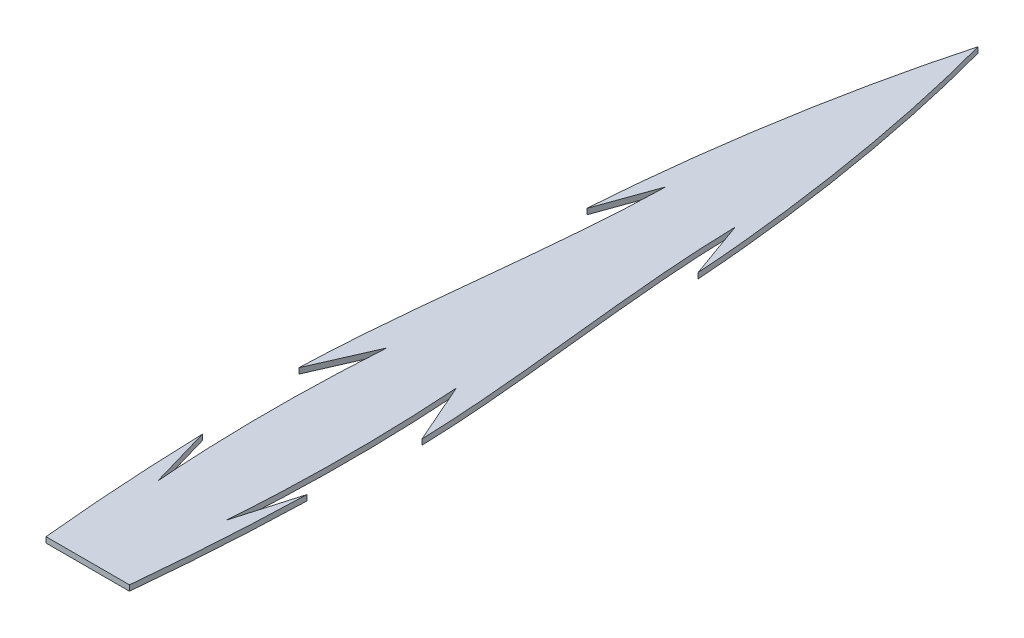
ISO-10303-21;
HEADER;
FILE_DESCRIPTION(('STEP AP214'),'2;1');
FILE_NAME('part.step','',(''),(''),'','','');
FILE_SCHEMA(('AUTOMOTIVE_DESIGN { 1 0 10303 214 1 1 1 1 }'));
ENDSEC;
DATA;
#1=APPLICATION_CONTEXT('core data for automotive mechanical design processes');
#2=APPLICATION_PROTOCOL_DEFINITION('international standard','automotive_design',2000,#1);
#3=PRODUCT_CONTEXT('',#1,'mechanical');
#4=PRODUCT('Part','Part','',(#3));
#5=PRODUCT_RELATED_PRODUCT_CATEGORY('part','',(#4));
#6=PRODUCT_DEFINITION_FORMATION('','',#4);
#7=PRODUCT_DEFINITION_CONTEXT('part definition',#1,'design');
#8=PRODUCT_DEFINITION('design','',#6,#7);
#9=PRODUCT_DEFINITION_SHAPE('','',#8);
#10=(LENGTH_UNIT() NAMED_UNIT(*) SI_UNIT(.MILLI.,.METRE.));
#11=(NAMED_UNIT(*) PLANE_ANGLE_UNIT() SI_UNIT($,.RADIAN.));
#12=(NAMED_UNIT(*) SI_UNIT($,.STERADIAN.) SOLID_ANGLE_UNIT());
#13=UNCERTAINTY_MEASURE_WITH_UNIT(LENGTH_MEASURE(1.E-05),#10,'distance_accuracy_value','');
#14=(GEOMETRIC_REPRESENTATION_CONTEXT(3) GLOBAL_UNCERTAINTY_ASSIGNED_CONTEXT((#13)) GLOBAL_UNIT_ASSIGNED_CONTEXT((#10,
#11,#12)) REPRESENTATION_CONTEXT('',''));
#15=CARTESIAN_POINT('',(0.,0.,0.));
#16=DIRECTION('',(0.,0.,1.));
#17=DIRECTION('',(1.,0.,0.));
#18=AXIS2_PLACEMENT_3D('',#15,#16,#17);
#19=CARTESIAN_POINT('',(-17.3442408581352,0.635,-7.60820097359175));
#20=DIRECTION('',(-0.915767275136995,0.,-0.401709220442055));
#21=DIRECTION('',(-0.401709220442055,0.,0.915767275136995));
#22=AXIS2_PLACEMENT_3D('',#19,#20,#21);
#23=PLANE('',#22);
#24=DIRECTION('',(0.401709220442055,0.,-0.915767275136995));
#25=VECTOR('',#24,1.);
#26=CARTESIAN_POINT('',(-17.3442408581352,0.,-7.60820097359175));
#27=LINE('',#26,#25);
#28=CARTESIAN_POINT('',(-7.02906212318897,0.,-31.1234768048454));
#29=VERTEX_POINT('',#28);
#30=CARTESIAN_POINT('',(-3.96875,0.,-38.1));
#31=VERTEX_POINT('',#30);
#32=EDGE_CURVE('E177',#29,#31,#27,.T.);
#33=ORIENTED_EDGE('',*,*,#32,.T.);
#34=DIRECTION('',(0.,-1.,0.));
#35=VECTOR('',#34,1.);
#36=CARTESIAN_POINT('',(-3.96875,0.635,-38.1));
#37=LINE('',#36,#35);
#38=CARTESIAN_POINT('',(-3.96875,0.635,-38.1));
#39=VERTEX_POINT('',#38);
#40=EDGE_CURVE('E11',#39,#31,#37,.T.);
#41=ORIENTED_EDGE('',*,*,#40,.F.);
#42=DIRECTION('',(0.401709220442055,0.,-0.915767275136995));
#43=VECTOR('',#42,1.);
#44=CARTESIAN_POINT('',(-17.3442408581352,0.635,-7.60820097359175));
#45=LINE('',#44,#43);
#46=CARTESIAN_POINT('',(-7.02906212318897,0.635,-31.1234768048454));
#47=VERTEX_POINT('',#46);
#48=EDGE_CURVE('E296',#47,#39,#45,.T.);
#49=ORIENTED_EDGE('',*,*,#48,.F.);
#50=DIRECTION('',(0.,-1.,0.));
#51=VECTOR('',#50,1.);
#52=CARTESIAN_POINT('',(-7.02906212318897,0.635,-31.1234768048454));
#53=LINE('',#52,#51);
#54=EDGE_CURVE('E167',#47,#29,#53,.T.);
#55=ORIENTED_EDGE('',*,*,#54,.T.);
#56=EDGE_LOOP('',(#33,#41,#49,#55));
#57=FACE_BOUND('',#56,.T.);
#58=ADVANCED_FACE('F33',(#57),#23,.F.);
#59=CARTESIAN_POINT('',(-3.96875,0.635,-38.1));
#60=CARTESIAN_POINT('',(-4.86792946579721,0.635,-24.5452097615645));
#61=CARTESIAN_POINT('',(-3.88994710607491,0.635,-11.8767031301696));
#62=B_SPLINE_CURVE_WITH_KNOTS('',2,(#59,#60,#61),.UNSPECIFIED.,.F.,.F.,(3,3),(0.,1.),.UNSPECIFIED.);
#63=DIRECTION('',(0.,-1.,0.));
#64=VECTOR('',#63,1.);
#65=SURFACE_OF_LINEAR_EXTRUSION('',#62,#64);
#66=CARTESIAN_POINT('',(-3.96875,0.,-38.1));
#67=CARTESIAN_POINT('',(-4.86792946579721,0.,-24.5452097615645));
#68=CARTESIAN_POINT('',(-3.88994710607491,0.,-11.8767031301696));
#69=B_SPLINE_CURVE_WITH_KNOTS('',2,(#66,#67,#68),.UNSPECIFIED.,.F.,.F.,(3,3),(0.,1.),.UNSPECIFIED.);
#70=CARTESIAN_POINT('',(-3.88994710607491,0.,-11.8767031301696));
#71=VERTEX_POINT('',#70);
#72=EDGE_CURVE('E308',#31,#71,#69,.T.);
#73=ORIENTED_EDGE('',*,*,#72,.T.);
#74=DIRECTION('',(0.,-1.,0.));
#75=VECTOR('',#74,1.);
#76=CARTESIAN_POINT('',(-3.88994710607491,0.635,-11.8767031301696));
#77=LINE('',#76,#75);
#78=CARTESIAN_POINT('',(-3.88994710607491,0.635,-11.8767031301696));
#79=VERTEX_POINT('',#78);
#80=EDGE_CURVE('E41',#79,#71,#77,.T.);
#81=ORIENTED_EDGE('',*,*,#80,.F.);
#82=EDGE_CURVE('E113',#39,#79,#62,.T.);
#83=ORIENTED_EDGE('',*,*,#82,.F.);
#84=ORIENTED_EDGE('',*,*,#40,.T.);
#85=EDGE_LOOP('',(#73,#81,#83,#84));
#86=FACE_BOUND('',#85,.T.);
#87=ADVANCED_FACE('F300',(#86),#65,.F.);
#88=CARTESIAN_POINT('',(-3.88994710607491,0.635,-11.8767031301696));
#89=CARTESIAN_POINT('',(-5.03752141007024,0.635,-15.708655714162));
#90=CARTESIAN_POINT('',(-5.969,0.635,-19.05));
#91=B_SPLINE_CURVE_WITH_KNOTS('',2,(#88,#89,#90),.UNSPECIFIED.,.F.,.F.,(3,3),(0.,1.),.UNSPECIFIED.);
#92=DIRECTION('',(0.,-1.,0.));
#93=VECTOR('',#92,1.);
#94=SURFACE_OF_LINEAR_EXTRUSION('',#91,#93);
#95=CARTESIAN_POINT('',(-3.88994710607491,0.,-11.8767031301696));
#96=CARTESIAN_POINT('',(-5.03752141007024,0.,-15.708655714162));
#97=CARTESIAN_POINT('',(-5.969,0.,-19.05));
#98=B_SPLINE_CURVE_WITH_KNOTS('',2,(#95,#96,#97),.UNSPECIFIED.,.F.,.F.,(3,3),(0.,1.),.UNSPECIFIED.);
#99=CARTESIAN_POINT('',(-5.969,0.,-19.05));
#100=VERTEX_POINT('',#99);
#101=EDGE_CURVE('E316',#71,#100,#98,.T.);
#102=ORIENTED_EDGE('',*,*,#101,.T.);
#103=DIRECTION('',(0.,-1.,0.));
#104=VECTOR('',#103,1.);
#105=CARTESIAN_POINT('',(-5.969,0.635,-19.05));
#106=LINE('',#105,#104);
#107=CARTESIAN_POINT('',(-5.969,0.635,-19.05));
#108=VERTEX_POINT('',#107);
#109=EDGE_CURVE('E320',#108,#100,#106,.T.);
#110=ORIENTED_EDGE('',*,*,#109,.F.);
#111=EDGE_CURVE('E281',#79,#108,#91,.T.);
#112=ORIENTED_EDGE('',*,*,#111,.F.);
#113=ORIENTED_EDGE('',*,*,#80,.T.);
#114=EDGE_LOOP('',(#102,#110,#112,#113));
#115=FACE_BOUND('',#114,.T.);
#116=ADVANCED_FACE('F273',(#115),#94,.F.);
#117=CARTESIAN_POINT('',(-4.7625,0.635,0.));
#118=CARTESIAN_POINT('',(-5.70640582398397,0.635,-9.50952936898695));
#119=CARTESIAN_POINT('',(-5.969,0.635,-19.05));
#120=B_SPLINE_CURVE_WITH_KNOTS('',2,(#117,#118,#119),.UNSPECIFIED.,.F.,.F.,(3,3),(0.,1.),.UNSPECIFIED.);
#121=DIRECTION('',(0.,-1.,0.));
#122=VECTOR('',#121,1.);
#123=SURFACE_OF_LINEAR_EXTRUSION('',#120,#122);
#124=CARTESIAN_POINT('',(-4.7625,0.,0.));
#125=CARTESIAN_POINT('',(-5.70640582398397,0.,-9.50952936898695));
#126=CARTESIAN_POINT('',(-5.969,0.,-19.05));
#127=B_SPLINE_CURVE_WITH_KNOTS('',2,(#124,#125,#126),.UNSPECIFIED.,.F.,.F.,(3,3),(0.,1.),.UNSPECIFIED.);
#128=CARTESIAN_POINT('',(-4.7625,0.,0.));
#129=VERTEX_POINT('',#128);
#130=EDGE_CURVE('E323',#129,#100,#127,.T.);
#131=ORIENTED_EDGE('',*,*,#130,.F.);
#132=DIRECTION('',(0.,-1.,0.));
#133=VECTOR('',#132,1.);
#134=CARTESIAN_POINT('',(-4.7625,0.635,0.));
#135=LINE('',#134,#133);
#136=CARTESIAN_POINT('',(-4.7625,0.635,0.));
#137=VERTEX_POINT('',#136);
#138=EDGE_CURVE('E418',#137,#129,#135,.T.);
#139=ORIENTED_EDGE('',*,*,#138,.F.);
#140=EDGE_CURVE('E276',#137,#108,#120,.T.);
#141=ORIENTED_EDGE('',*,*,#140,.T.);
#142=ORIENTED_EDGE('',*,*,#109,.T.);
#143=EDGE_LOOP('',(#131,#139,#141,#142));
#144=FACE_BOUND('',#143,.T.);
#145=ADVANCED_FACE('F269',(#144),#123,.T.);
#146=CARTESIAN_POINT('',(0.,0.635,0.));
#147=DIRECTION('',(0.,0.,-1.));
#148=DIRECTION('',(-1.,0.,0.));
#149=AXIS2_PLACEMENT_3D('',#146,#147,#148);
#150=PLANE('',#149);
#151=DIRECTION('',(1.,0.,0.));
#152=VECTOR('',#151,1.);
#153=CARTESIAN_POINT('',(0.,0.,0.));
#154=LINE('',#153,#152);
#155=CARTESIAN_POINT('',(4.7625,0.,0.));
#156=VERTEX_POINT('',#155);
#157=EDGE_CURVE('E325',#129,#156,#154,.T.);
#158=ORIENTED_EDGE('',*,*,#157,.T.);
#159=DIRECTION('',(0.,-1.,0.));
#160=VECTOR('',#159,1.);
#161=CARTESIAN_POINT('',(4.7625,0.635,0.));
#162=LINE('',#161,#160);
#163=CARTESIAN_POINT('',(4.7625,0.635,0.));
#164=VERTEX_POINT('',#163);
#165=EDGE_CURVE('E415',#164,#156,#162,.T.);
#166=ORIENTED_EDGE('',*,*,#165,.F.);
#167=DIRECTION('',(1.,0.,0.));
#168=VECTOR('',#167,1.);
#169=CARTESIAN_POINT('',(0.,0.635,0.));
#170=LINE('',#169,#168);
#171=EDGE_CURVE('E257',#137,#164,#170,.T.);
#172=ORIENTED_EDGE('',*,*,#171,.F.);
#173=ORIENTED_EDGE('',*,*,#138,.T.);
#174=EDGE_LOOP('',(#158,#166,#172,#173));
#175=FACE_BOUND('',#174,.T.);
#176=ADVANCED_FACE('F265',(#175),#150,.F.);
#177=CARTESIAN_POINT('',(4.7625,0.635,0.));
#178=CARTESIAN_POINT('',(5.70640582398397,0.635,-9.50952936898695));
#179=CARTESIAN_POINT('',(5.969,0.635,-19.05));
#180=B_SPLINE_CURVE_WITH_KNOTS('',2,(#177,#178,#179),.UNSPECIFIED.,.F.,.F.,(3,3),(0.,1.),.UNSPECIFIED.);
#181=DIRECTION('',(0.,-1.,0.));
#182=VECTOR('',#181,1.);
#183=SURFACE_OF_LINEAR_EXTRUSION('',#180,#182);
#184=CARTESIAN_POINT('',(4.7625,0.,0.));
#185=CARTESIAN_POINT('',(5.70640582398397,0.,-9.50952936898695));
#186=CARTESIAN_POINT('',(5.969,0.,-19.05));
#187=B_SPLINE_CURVE_WITH_KNOTS('',2,(#184,#185,#186),.UNSPECIFIED.,.F.,.F.,(3,3),(0.,1.),.UNSPECIFIED.);
#188=CARTESIAN_POINT('',(5.969,0.,-19.05));
#189=VERTEX_POINT('',#188);
#190=EDGE_CURVE('E341',#156,#189,#187,.T.);
#191=ORIENTED_EDGE('',*,*,#190,.T.);
#192=DIRECTION('',(0.,-1.,0.));
#193=VECTOR('',#192,1.);
#194=CARTESIAN_POINT('',(5.969,0.635,-19.05));
#195=LINE('',#194,#193);
#196=CARTESIAN_POINT('',(5.969,0.635,-19.05));
#197=VERTEX_POINT('',#196);
#198=EDGE_CURVE('E413',#197,#189,#195,.T.);
#199=ORIENTED_EDGE('',*,*,#198,.F.);
#200=EDGE_CURVE('E249',#164,#197,#180,.T.);
#201=ORIENTED_EDGE('',*,*,#200,.F.);
#202=ORIENTED_EDGE('',*,*,#165,.T.);
#203=EDGE_LOOP('',(#191,#199,#201,#202));
#204=FACE_BOUND('',#203,.T.);
#205=ADVANCED_FACE('F262',(#204),#183,.F.);
#206=CARTESIAN_POINT('',(3.88994710607491,0.635,-11.8767031301696));
#207=CARTESIAN_POINT('',(5.03752141007024,0.635,-15.708655714162));
#208=CARTESIAN_POINT('',(5.969,0.635,-19.05));
#209=B_SPLINE_CURVE_WITH_KNOTS('',2,(#206,#207,#208),.UNSPECIFIED.,.F.,.F.,(3,3),(0.,1.),.UNSPECIFIED.);
#210=DIRECTION('',(0.,-1.,0.));
#211=VECTOR('',#210,1.);
#212=SURFACE_OF_LINEAR_EXTRUSION('',#209,#211);
#213=CARTESIAN_POINT('',(3.88994710607491,0.,-11.8767031301696));
#214=CARTESIAN_POINT('',(5.03752141007024,0.,-15.708655714162));
#215=CARTESIAN_POINT('',(5.969,0.,-19.05));
#216=B_SPLINE_CURVE_WITH_KNOTS('',2,(#213,#214,#215),.UNSPECIFIED.,.F.,.F.,(3,3),(0.,1.),.UNSPECIFIED.);
#217=CARTESIAN_POINT('',(3.88994710607491,0.,-11.8767031301696));
#218=VERTEX_POINT('',#217);
#219=EDGE_CURVE('E346',#218,#189,#216,.T.);
#220=ORIENTED_EDGE('',*,*,#219,.F.);
#221=DIRECTION('',(0.,-1.,0.));
#222=VECTOR('',#221,1.);
#223=CARTESIAN_POINT('',(3.88994710607491,0.635,-11.8767031301696));
#224=LINE('',#223,#222);
#225=CARTESIAN_POINT('',(3.88994710607491,0.635,-11.8767031301696));
#226=VERTEX_POINT('',#225);
#227=EDGE_CURVE('E411',#226,#218,#224,.T.);
#228=ORIENTED_EDGE('',*,*,#227,.F.);
#229=EDGE_CURVE('E240',#226,#197,#209,.T.);
#230=ORIENTED_EDGE('',*,*,#229,.T.);
#231=ORIENTED_EDGE('',*,*,#198,.T.);
#232=EDGE_LOOP('',(#220,#228,#230,#231));
#233=FACE_BOUND('',#232,.T.);
#234=ADVANCED_FACE('F231',(#233),#212,.T.);
#235=CARTESIAN_POINT('',(3.96875,0.635,-38.1));
#236=CARTESIAN_POINT('',(4.86792946579721,0.635,-24.5452097615645));
#237=CARTESIAN_POINT('',(3.88994710607491,0.635,-11.8767031301696));
#238=B_SPLINE_CURVE_WITH_KNOTS('',2,(#235,#236,#237),.UNSPECIFIED.,.F.,.F.,(3,3),(0.,1.),.UNSPECIFIED.);
#239=DIRECTION('',(0.,-1.,0.));
#240=VECTOR('',#239,1.);
#241=SURFACE_OF_LINEAR_EXTRUSION('',#238,#240);
#242=CARTESIAN_POINT('',(3.96875,0.,-38.1));
#243=CARTESIAN_POINT('',(4.86792946579721,0.,-24.5452097615645));
#244=CARTESIAN_POINT('',(3.88994710607491,0.,-11.8767031301696));
#245=B_SPLINE_CURVE_WITH_KNOTS('',2,(#242,#243,#244),.UNSPECIFIED.,.F.,.F.,(3,3),(0.,1.),.UNSPECIFIED.);
#246=CARTESIAN_POINT('',(3.96875,0.,-38.1));
#247=VERTEX_POINT('',#246);
#248=EDGE_CURVE('E354',#247,#218,#245,.T.);
#249=ORIENTED_EDGE('',*,*,#248,.F.);
#250=DIRECTION('',(0.,-1.,0.));
#251=VECTOR('',#250,1.);
#252=CARTESIAN_POINT('',(3.96875,0.635,-38.1));
#253=LINE('',#252,#251);
#254=CARTESIAN_POINT('',(3.96875,0.635,-38.1));
#255=VERTEX_POINT('',#254);
#256=EDGE_CURVE('E409',#255,#247,#253,.T.);
#257=ORIENTED_EDGE('',*,*,#256,.F.);
#258=EDGE_CURVE('E235',#255,#226,#238,.T.);
#259=ORIENTED_EDGE('',*,*,#258,.T.);
#260=ORIENTED_EDGE('',*,*,#227,.T.);
#261=EDGE_LOOP('',(#249,#257,#259,#260));
#262=FACE_BOUND('',#261,.T.);
#263=ADVANCED_FACE('F227',(#262),#241,.T.);
#264=CARTESIAN_POINT('',(17.3442408581352,0.635,-7.60820097359175));
#265=DIRECTION('',(-0.915767275136995,0.,0.401709220442055));
#266=DIRECTION('',(0.401709220442055,0.,0.915767275136995));
#267=AXIS2_PLACEMENT_3D('',#264,#265,#266);
#268=PLANE('',#267);
#269=DIRECTION('',(-0.401709220442055,0.,-0.915767275136995));
#270=VECTOR('',#269,1.);
#271=CARTESIAN_POINT('',(17.3442408581352,0.,-7.60820097359175));
#272=LINE('',#271,#270);
#273=CARTESIAN_POINT('',(7.02906212318897,0.,-31.1234768048454));
#274=VERTEX_POINT('',#273);
#275=EDGE_CURVE('E362',#274,#247,#272,.T.);
#276=ORIENTED_EDGE('',*,*,#275,.F.);
#277=DIRECTION('',(0.,-1.,0.));
#278=VECTOR('',#277,1.);
#279=CARTESIAN_POINT('',(7.02906212318897,0.635,-31.1234768048454));
#280=LINE('',#279,#278);
#281=CARTESIAN_POINT('',(7.02906212318897,0.635,-31.1234768048454));
#282=VERTEX_POINT('',#281);
#283=EDGE_CURVE('E407',#282,#274,#280,.T.);
#284=ORIENTED_EDGE('',*,*,#283,.F.);
#285=DIRECTION('',(-0.401709220442055,0.,-0.915767275136995));
#286=VECTOR('',#285,1.);
#287=CARTESIAN_POINT('',(17.3442408581352,0.635,-7.60820097359175));
#288=LINE('',#287,#286);
#289=EDGE_CURVE('E215',#282,#255,#288,.T.);
#290=ORIENTED_EDGE('',*,*,#289,.T.);
#291=ORIENTED_EDGE('',*,*,#256,.T.);
#292=EDGE_LOOP('',(#276,#284,#290,#291));
#293=FACE_BOUND('',#292,.T.);
#294=ADVANCED_FACE('F223',(#293),#268,.T.);
#295=CARTESIAN_POINT('',(3.96875,0.635,-69.9328980340927));
#296=CARTESIAN_POINT('',(4.22646450259615,0.635,-57.2244913441782));
#297=CARTESIAN_POINT('',(6.64541781304138,0.635,-43.8634093479659));
#298=CARTESIAN_POINT('',(7.02906212318898,0.635,-31.1234768048454));
#299=B_SPLINE_CURVE_WITH_KNOTS('',3,(#295,#296,#297,#298),.UNSPECIFIED.,.F.,.F.,(4,4),(0.,1.),.UNSPECIFIED.);
#300=DIRECTION('',(0.,-1.,0.));
#301=VECTOR('',#300,1.);
#302=SURFACE_OF_LINEAR_EXTRUSION('',#299,#301);
#303=CARTESIAN_POINT('',(3.96875,0.,-69.9328980340927));
#304=CARTESIAN_POINT('',(4.22646450259615,0.,-57.2244913441782));
#305=CARTESIAN_POINT('',(6.64541781304138,0.,-43.8634093479659));
#306=CARTESIAN_POINT('',(7.02906212318898,0.,-31.1234768048454));
#307=B_SPLINE_CURVE_WITH_KNOTS('',3,(#303,#304,#305,#306),.UNSPECIFIED.,.F.,.F.,(4,4),(0.,1.),.UNSPECIFIED.);
#308=CARTESIAN_POINT('',(3.96875,0.,-69.9328980340927));
#309=VERTEX_POINT('',#308);
#310=EDGE_CURVE('E368',#309,#274,#307,.T.);
#311=ORIENTED_EDGE('',*,*,#310,.F.);
#312=DIRECTION('',(0.,-1.,0.));
#313=VECTOR('',#312,1.);
#314=CARTESIAN_POINT('',(3.96875,0.635,-69.9328980340927));
#315=LINE('',#314,#313);
#316=CARTESIAN_POINT('',(3.96875,0.635,-69.9328980340927));
#317=VERTEX_POINT('',#316);
#318=EDGE_CURVE('E405',#317,#309,#315,.T.);
#319=ORIENTED_EDGE('',*,*,#318,.F.);
#320=EDGE_CURVE('E209',#317,#282,#299,.T.);
#321=ORIENTED_EDGE('',*,*,#320,.T.);
#322=ORIENTED_EDGE('',*,*,#283,.T.);
#323=EDGE_LOOP('',(#311,#319,#321,#322));
#324=FACE_BOUND('',#323,.T.);
#325=ADVANCED_FACE('F220',(#324),#302,.T.);
#326=CARTESIAN_POINT('',(25.7159529522387,0.635,-9.20984774865024));
#327=DIRECTION('',(-0.941444940128178,0.,0.337166760976005));
#328=DIRECTION('',(0.337166760976005,0.,0.941444940128179));
#329=AXIS2_PLACEMENT_3D('',#326,#327,#328);
#330=PLANE('',#329);
#331=DIRECTION('',(-0.337166760976005,0.,-0.941444940128179));
#332=VECTOR('',#331,1.);
#333=CARTESIAN_POINT('',(25.7159529522387,0.,-9.20984774865024));
#334=LINE('',#333,#332);
#335=CARTESIAN_POINT('',(6.34201864763795,0.,-63.3062016378765));
#336=VERTEX_POINT('',#335);
#337=EDGE_CURVE('E373',#336,#309,#334,.T.);
#338=ORIENTED_EDGE('',*,*,#337,.F.);
#339=DIRECTION('',(0.,-1.,0.));
#340=VECTOR('',#339,1.);
#341=CARTESIAN_POINT('',(6.34201864763795,0.635,-63.3062016378765));
#342=LINE('',#341,#340);
#343=CARTESIAN_POINT('',(6.34201864763795,0.635,-63.3062016378765));
#344=VERTEX_POINT('',#343);
#345=EDGE_CURVE('E403',#344,#336,#342,.T.);
#346=ORIENTED_EDGE('',*,*,#345,.F.);
#347=DIRECTION('',(-0.337166760976005,0.,-0.941444940128179));
#348=VECTOR('',#347,1.);
#349=CARTESIAN_POINT('',(25.7159529522387,0.635,-9.20984774865024));
#350=LINE('',#349,#348);
#351=EDGE_CURVE('E203',#344,#317,#350,.T.);
#352=ORIENTED_EDGE('',*,*,#351,.T.);
#353=ORIENTED_EDGE('',*,*,#318,.T.);
#354=EDGE_LOOP('',(#338,#346,#352,#353));
#355=FACE_BOUND('',#354,.T.);
#356=ADVANCED_FACE('F196',(#355),#330,.T.);
#357=CARTESIAN_POINT('',(0.,0.635,-101.6));
#358=CARTESIAN_POINT('',(3.29157343977617,0.635,-89.5537246465218));
#359=CARTESIAN_POINT('',(5.50792857851426,0.635,-75.6315314737123));
#360=CARTESIAN_POINT('',(6.34201864763795,0.635,-63.3062016378765));
#361=B_SPLINE_CURVE_WITH_KNOTS('',3,(#357,#358,#359,#360),.UNSPECIFIED.,.F.,.F.,(4,4),(0.,1.),.UNSPECIFIED.);
#362=DIRECTION('',(0.,-1.,0.));
#363=VECTOR('',#362,1.);
#364=SURFACE_OF_LINEAR_EXTRUSION('',#361,#363);
#365=CARTESIAN_POINT('',(0.,0.,-101.6));
#366=CARTESIAN_POINT('',(3.29157343977617,0.,-89.5537246465218));
#367=CARTESIAN_POINT('',(5.50792857851426,0.,-75.6315314737123));
#368=CARTESIAN_POINT('',(6.34201864763795,0.,-63.3062016378765));
#369=B_SPLINE_CURVE_WITH_KNOTS('',3,(#365,#366,#367,#368),.UNSPECIFIED.,.F.,.F.,(4,4),(0.,1.),.UNSPECIFIED.);
#370=CARTESIAN_POINT('',(0.,0.,-101.6));
#371=VERTEX_POINT('',#370);
#372=EDGE_CURVE('E379',#371,#336,#369,.T.);
#373=ORIENTED_EDGE('',*,*,#372,.F.);
#374=DIRECTION('',(0.,-1.,0.));
#375=VECTOR('',#374,1.);
#376=CARTESIAN_POINT('',(0.,0.635,-101.6));
#377=LINE('',#376,#375);
#378=CARTESIAN_POINT('',(0.,0.635,-101.6));
#379=VERTEX_POINT('',#378);
#380=EDGE_CURVE('E162',#379,#371,#377,.T.);
#381=ORIENTED_EDGE('',*,*,#380,.F.);
#382=EDGE_CURVE('E155',#379,#344,#361,.T.);
#383=ORIENTED_EDGE('',*,*,#382,.T.);
#384=ORIENTED_EDGE('',*,*,#345,.T.);
#385=EDGE_LOOP('',(#373,#381,#383,#384));
#386=FACE_BOUND('',#385,.T.);
#387=ADVANCED_FACE('F193',(#386),#364,.T.);
#388=CARTESIAN_POINT('',(0.,0.635,-101.6));
#389=CARTESIAN_POINT('',(-3.29157343977617,0.635,-89.5537246465218));
#390=CARTESIAN_POINT('',(-5.50792857851426,0.635,-75.6315314737123));
#391=CARTESIAN_POINT('',(-6.34201864763795,0.635,-63.3062016378765));
#392=B_SPLINE_CURVE_WITH_KNOTS('',3,(#388,#389,#390,#391),.UNSPECIFIED.,.F.,.F.,(4,4),(0.,1.),.UNSPECIFIED.);
#393=DIRECTION('',(0.,-1.,0.));
#394=VECTOR('',#393,1.);
#395=SURFACE_OF_LINEAR_EXTRUSION('',#392,#394);
#396=CARTESIAN_POINT('',(0.,0.,-101.6));
#397=CARTESIAN_POINT('',(-3.29157343977617,0.,-89.5537246465218));
#398=CARTESIAN_POINT('',(-5.50792857851426,0.,-75.6315314737123));
#399=CARTESIAN_POINT('',(-6.34201864763795,0.,-63.3062016378765));
#400=B_SPLINE_CURVE_WITH_KNOTS('',3,(#396,#397,#398,#399),.UNSPECIFIED.,.F.,.F.,(4,4),(0.,1.),.UNSPECIFIED.);
#401=CARTESIAN_POINT('',(-6.34201864763795,0.,-63.3062016378765));
#402=VERTEX_POINT('',#401);
#403=EDGE_CURVE('E161',#371,#402,#400,.T.);
#404=ORIENTED_EDGE('',*,*,#403,.T.);
#405=DIRECTION('',(0.,-1.,0.));
#406=VECTOR('',#405,1.);
#407=CARTESIAN_POINT('',(-6.34201864763795,0.635,-63.3062016378765));
#408=LINE('',#407,#406);
#409=CARTESIAN_POINT('',(-6.34201864763795,0.635,-63.3062016378765));
#410=VERTEX_POINT('',#409);
#411=EDGE_CURVE('E158',#410,#402,#408,.T.);
#412=ORIENTED_EDGE('',*,*,#411,.F.);
#413=EDGE_CURVE('E148',#379,#410,#392,.T.);
#414=ORIENTED_EDGE('',*,*,#413,.F.);
#415=ORIENTED_EDGE('',*,*,#380,.T.);
#416=EDGE_LOOP('',(#404,#412,#414,#415));
#417=FACE_BOUND('',#416,.T.);
#418=ADVANCED_FACE('F159',(#417),#395,.F.);
#419=CARTESIAN_POINT('',(-25.7159529522387,0.635,-9.20984774865024));
#420=DIRECTION('',(-0.941444940128178,0.,-0.337166760976005));
#421=DIRECTION('',(-0.337166760976005,0.,0.941444940128179));
#422=AXIS2_PLACEMENT_3D('',#419,#420,#421);
#423=PLANE('',#422);
#424=DIRECTION('',(0.337166760976005,0.,-0.941444940128179));
#425=VECTOR('',#424,1.);
#426=CARTESIAN_POINT('',(-25.7159529522387,0.,-9.20984774865024));
#427=LINE('',#426,#425);
#428=CARTESIAN_POINT('',(-3.96875,0.,-69.9328980340927));
#429=VERTEX_POINT('',#428);
#430=EDGE_CURVE('E99',#402,#429,#427,.T.);
#431=ORIENTED_EDGE('',*,*,#430,.T.);
#432=DIRECTION('',(0.,-1.,0.));
#433=VECTOR('',#432,1.);
#434=CARTESIAN_POINT('',(-3.96875,0.635,-69.9328980340927));
#435=LINE('',#434,#433);
#436=CARTESIAN_POINT('',(-3.96875,0.635,-69.9328980340927));
#437=VERTEX_POINT('',#436);
#438=EDGE_CURVE('E163',#437,#429,#435,.T.);
#439=ORIENTED_EDGE('',*,*,#438,.F.);
#440=DIRECTION('',(0.337166760976005,0.,-0.941444940128179));
#441=VECTOR('',#440,1.);
#442=CARTESIAN_POINT('',(-25.7159529522387,0.635,-9.20984774865024));
#443=LINE('',#442,#441);
#444=EDGE_CURVE('E152',#410,#437,#443,.T.);
#445=ORIENTED_EDGE('',*,*,#444,.F.);
#446=ORIENTED_EDGE('',*,*,#411,.T.);
#447=EDGE_LOOP('',(#431,#439,#445,#446));
#448=FACE_BOUND('',#447,.T.);
#449=ADVANCED_FACE('F165',(#448),#423,.F.);
#450=CARTESIAN_POINT('',(-3.96875,0.635,-69.9328980340927));
#451=CARTESIAN_POINT('',(-4.22646450259615,0.635,-57.2244913441782));
#452=CARTESIAN_POINT('',(-6.64541781304138,0.635,-43.8634093479659));
#453=CARTESIAN_POINT('',(-7.02906212318898,0.635,-31.1234768048454));
#454=B_SPLINE_CURVE_WITH_KNOTS('',3,(#450,#451,#452,#453),.UNSPECIFIED.,.F.,.F.,(4,4),(0.,1.),.UNSPECIFIED.);
#455=DIRECTION('',(0.,-1.,0.));
#456=VECTOR('',#455,1.);
#457=SURFACE_OF_LINEAR_EXTRUSION('',#454,#456);
#458=CARTESIAN_POINT('',(-3.96875,0.,-69.9328980340927));
#459=CARTESIAN_POINT('',(-4.22646450259615,0.,-57.2244913441782));
#460=CARTESIAN_POINT('',(-6.64541781304138,0.,-43.8634093479659));
#461=CARTESIAN_POINT('',(-7.02906212318898,0.,-31.1234768048454));
#462=B_SPLINE_CURVE_WITH_KNOTS('',3,(#458,#459,#460,#461),.UNSPECIFIED.,.F.,.F.,(4,4),(0.,1.),.UNSPECIFIED.);
#463=EDGE_CURVE('E105',#429,#29,#462,.T.);
#464=ORIENTED_EDGE('',*,*,#463,.T.);
#465=ORIENTED_EDGE('',*,*,#54,.F.);
#466=EDGE_CURVE('E49',#437,#47,#454,.T.);
#467=ORIENTED_EDGE('',*,*,#466,.F.);
#468=ORIENTED_EDGE('',*,*,#438,.T.);
#469=EDGE_LOOP('',(#464,#465,#467,#468));
#470=FACE_BOUND('',#469,.T.);
#471=ADVANCED_FACE('F183',(#470),#457,.F.);
#472=CARTESIAN_POINT('',(0.,0.635,0.));
#473=DIRECTION('',(0.,1.,0.));
#474=DIRECTION('',(0.,0.,1.));
#475=AXIS2_PLACEMENT_3D('',#472,#473,#474);
#476=PLANE('',#475);
#477=ORIENTED_EDGE('',*,*,#48,.T.);
#478=ORIENTED_EDGE('',*,*,#82,.T.);
#479=ORIENTED_EDGE('',*,*,#111,.T.);
#480=ORIENTED_EDGE('',*,*,#140,.F.);
#481=ORIENTED_EDGE('',*,*,#171,.T.);
#482=ORIENTED_EDGE('',*,*,#200,.T.);
#483=ORIENTED_EDGE('',*,*,#229,.F.);
#484=ORIENTED_EDGE('',*,*,#258,.F.);
#485=ORIENTED_EDGE('',*,*,#289,.F.);
#486=ORIENTED_EDGE('',*,*,#320,.F.);
#487=ORIENTED_EDGE('',*,*,#351,.F.);
#488=ORIENTED_EDGE('',*,*,#382,.F.);
#489=ORIENTED_EDGE('',*,*,#413,.T.);
#490=ORIENTED_EDGE('',*,*,#444,.T.);
#491=ORIENTED_EDGE('',*,*,#466,.T.);
#492=EDGE_LOOP('',(#477,#478,#479,#480,#481,#482,#483,#484,#485,#486,#487,#488,#489,#490,#491));
#493=FACE_BOUND('',#492,.T.);
#494=ADVANCED_FACE('F150',(#493),#476,.T.);
#495=CARTESIAN_POINT('',(0.,0.,0.));
#496=DIRECTION('',(0.,1.,0.));
#497=DIRECTION('',(0.,0.,1.));
#498=AXIS2_PLACEMENT_3D('',#495,#496,#497);
#499=PLANE('',#498);
#500=ORIENTED_EDGE('',*,*,#32,.F.);
#501=ORIENTED_EDGE('',*,*,#463,.F.);
#502=ORIENTED_EDGE('',*,*,#430,.F.);
#503=ORIENTED_EDGE('',*,*,#403,.F.);
#504=ORIENTED_EDGE('',*,*,#372,.T.);
#505=ORIENTED_EDGE('',*,*,#337,.T.);
#506=ORIENTED_EDGE('',*,*,#310,.T.);
#507=ORIENTED_EDGE('',*,*,#275,.T.);
#508=ORIENTED_EDGE('',*,*,#248,.T.);
#509=ORIENTED_EDGE('',*,*,#219,.T.);
#510=ORIENTED_EDGE('',*,*,#190,.F.);
#511=ORIENTED_EDGE('',*,*,#157,.F.);
#512=ORIENTED_EDGE('',*,*,#130,.T.);
#513=ORIENTED_EDGE('',*,*,#101,.F.);
#514=ORIENTED_EDGE('',*,*,#72,.F.);
#515=EDGE_LOOP('',(#500,#501,#502,#503,#504,#505,#506,#507,#508,#509,#510,#511,#512,#513,#514));
#516=FACE_BOUND('',#515,.T.);
#517=ADVANCED_FACE('F187',(#516),#499,.F.);
#518=CLOSED_SHELL('',(#58,#87,#116,#145,#176,#205,#234,#263,#294,#325,#356,#387,#418,#449,#471,
#494,#517));
#519=MANIFOLD_SOLID_BREP('B2',#518);
#520=ADVANCED_BREP_SHAPE_REPRESENTATION('',(#18,#519),#14);
#521=SHAPE_DEFINITION_REPRESENTATION(#9,#520);
ENDSEC;
END-ISO-10303-21;
